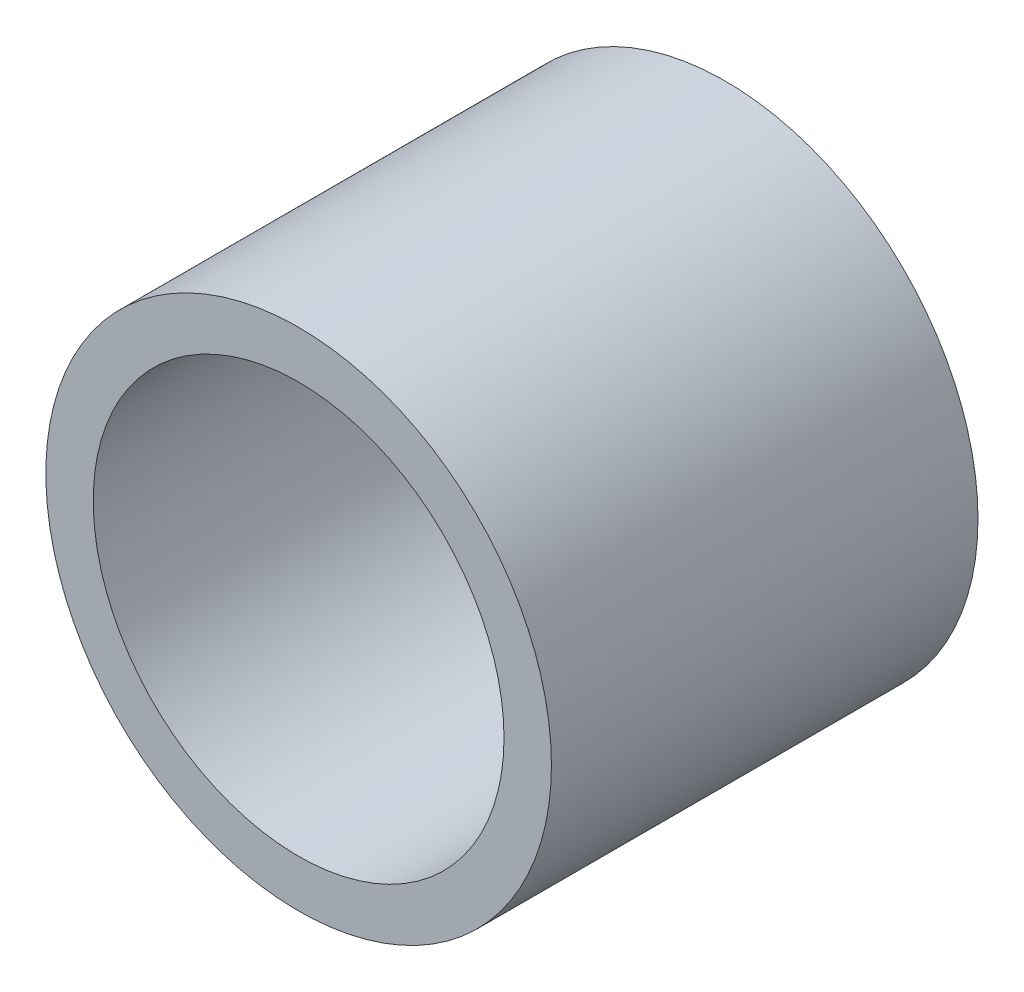
ISO-10303-21;
HEADER;
FILE_DESCRIPTION(('STEP AP214'),'2;1');
FILE_NAME('part.step','',(''),(''),'','','');
FILE_SCHEMA(('AUTOMOTIVE_DESIGN { 1 0 10303 214 1 1 1 1 }'));
ENDSEC;
DATA;
#1=APPLICATION_CONTEXT('core data for automotive mechanical design processes');
#2=APPLICATION_PROTOCOL_DEFINITION('international standard','automotive_design',2000,#1);
#3=PRODUCT_CONTEXT('',#1,'mechanical');
#4=PRODUCT('Part','Part','',(#3));
#5=PRODUCT_RELATED_PRODUCT_CATEGORY('part','',(#4));
#6=PRODUCT_DEFINITION_FORMATION('','',#4);
#7=PRODUCT_DEFINITION_CONTEXT('part definition',#1,'design');
#8=PRODUCT_DEFINITION('design','',#6,#7);
#9=PRODUCT_DEFINITION_SHAPE('','',#8);
#10=(LENGTH_UNIT() NAMED_UNIT(*) SI_UNIT(.MILLI.,.METRE.));
#11=(NAMED_UNIT(*) PLANE_ANGLE_UNIT() SI_UNIT($,.RADIAN.));
#12=(NAMED_UNIT(*) SI_UNIT($,.STERADIAN.) SOLID_ANGLE_UNIT());
#13=UNCERTAINTY_MEASURE_WITH_UNIT(LENGTH_MEASURE(1.E-05),#10,'distance_accuracy_value','');
#14=(GEOMETRIC_REPRESENTATION_CONTEXT(3) GLOBAL_UNCERTAINTY_ASSIGNED_CONTEXT((#13)) GLOBAL_UNIT_ASSIGNED_CONTEXT((#10,
#11,#12)) REPRESENTATION_CONTEXT('',''));
#15=CARTESIAN_POINT('',(0.,0.,0.));
#16=DIRECTION('',(0.,0.,1.));
#17=DIRECTION('',(1.,0.,0.));
#18=AXIS2_PLACEMENT_3D('',#15,#16,#17);
#19=CARTESIAN_POINT('',(0.,0.,13.5));
#20=DIRECTION('',(0.,0.,1.));
#21=DIRECTION('',(1.,0.,0.));
#22=AXIS2_PLACEMENT_3D('',#19,#20,#21);
#23=PLANE('',#22);
#24=CARTESIAN_POINT('',(0.,0.,13.5));
#25=DIRECTION('',(0.,0.,1.));
#26=DIRECTION('',(1.,0.,0.));
#27=AXIS2_PLACEMENT_3D('',#24,#25,#26);
#28=CIRCLE('',#27,16.);
#29=CARTESIAN_POINT('',(16.,0.,13.5));
#30=VERTEX_POINT('',#29);
#31=EDGE_CURVE('E10',#30,#30,#28,.T.);
#32=ORIENTED_EDGE('',*,*,#31,.T.);
#33=EDGE_LOOP('',(#32));
#34=FACE_BOUND('',#33,.T.);
#35=CARTESIAN_POINT('',(0.,0.,13.5));
#36=DIRECTION('',(0.,0.,1.));
#37=DIRECTION('',(1.,0.,0.));
#38=AXIS2_PLACEMENT_3D('',#35,#36,#37);
#39=CIRCLE('',#38,13.);
#40=CARTESIAN_POINT('',(13.,0.,13.5));
#41=VERTEX_POINT('',#40);
#42=EDGE_CURVE('E43',#41,#41,#39,.T.);
#43=ORIENTED_EDGE('',*,*,#42,.F.);
#44=EDGE_LOOP('',(#43));
#45=FACE_BOUND('',#44,.T.);
#46=ADVANCED_FACE('F32',(#34,#45),#23,.T.);
#47=CARTESIAN_POINT('',(0.,0.,-13.5));
#48=DIRECTION('',(0.,0.,1.));
#49=DIRECTION('',(1.,0.,0.));
#50=AXIS2_PLACEMENT_3D('',#47,#48,#49);
#51=PLANE('',#50);
#52=CARTESIAN_POINT('',(0.,0.,-13.5));
#53=DIRECTION('',(0.,0.,1.));
#54=DIRECTION('',(1.,0.,0.));
#55=AXIS2_PLACEMENT_3D('',#52,#53,#54);
#56=CIRCLE('',#55,16.);
#57=CARTESIAN_POINT('',(16.,0.,-13.5));
#58=VERTEX_POINT('',#57);
#59=EDGE_CURVE('E36',#58,#58,#56,.T.);
#60=ORIENTED_EDGE('',*,*,#59,.F.);
#61=EDGE_LOOP('',(#60));
#62=FACE_BOUND('',#61,.T.);
#63=CARTESIAN_POINT('',(0.,0.,-13.5));
#64=DIRECTION('',(0.,0.,1.));
#65=DIRECTION('',(1.,0.,0.));
#66=AXIS2_PLACEMENT_3D('',#63,#64,#65);
#67=CIRCLE('',#66,13.);
#68=CARTESIAN_POINT('',(13.,0.,-13.5));
#69=VERTEX_POINT('',#68);
#70=EDGE_CURVE('E45',#69,#69,#67,.T.);
#71=ORIENTED_EDGE('',*,*,#70,.T.);
#72=EDGE_LOOP('',(#71));
#73=FACE_BOUND('',#72,.T.);
#74=ADVANCED_FACE('F55',(#62,#73),#51,.F.);
#75=CARTESIAN_POINT('',(0.,0.,13.5));
#76=DIRECTION('',(0.,0.,-1.));
#77=DIRECTION('',(-1.,0.,0.));
#78=AXIS2_PLACEMENT_3D('',#75,#76,#77);
#79=CYLINDRICAL_SURFACE('',#78,16.);
#80=ORIENTED_EDGE('',*,*,#31,.F.);
#81=EDGE_LOOP('',(#80));
#82=FACE_BOUND('',#81,.T.);
#83=ORIENTED_EDGE('',*,*,#59,.T.);
#84=EDGE_LOOP('',(#83));
#85=FACE_BOUND('',#84,.T.);
#86=ADVANCED_FACE('F34',(#82,#85),#79,.T.);
#87=CARTESIAN_POINT('',(0.,0.,13.5));
#88=DIRECTION('',(0.,0.,-1.));
#89=DIRECTION('',(-1.,0.,0.));
#90=AXIS2_PLACEMENT_3D('',#87,#88,#89);
#91=CYLINDRICAL_SURFACE('',#90,13.);
#92=ORIENTED_EDGE('',*,*,#42,.T.);
#93=EDGE_LOOP('',(#92));
#94=FACE_BOUND('',#93,.T.);
#95=ORIENTED_EDGE('',*,*,#70,.F.);
#96=EDGE_LOOP('',(#95));
#97=FACE_BOUND('',#96,.T.);
#98=ADVANCED_FACE('F51',(#94,#97),#91,.F.);
#99=CLOSED_SHELL('',(#46,#74,#86,#98));
#100=MANIFOLD_SOLID_BREP('B2',#99);
#101=ADVANCED_BREP_SHAPE_REPRESENTATION('',(#18,#100),#14);
#102=SHAPE_DEFINITION_REPRESENTATION(#9,#101);
ENDSEC;
END-ISO-10303-21;
